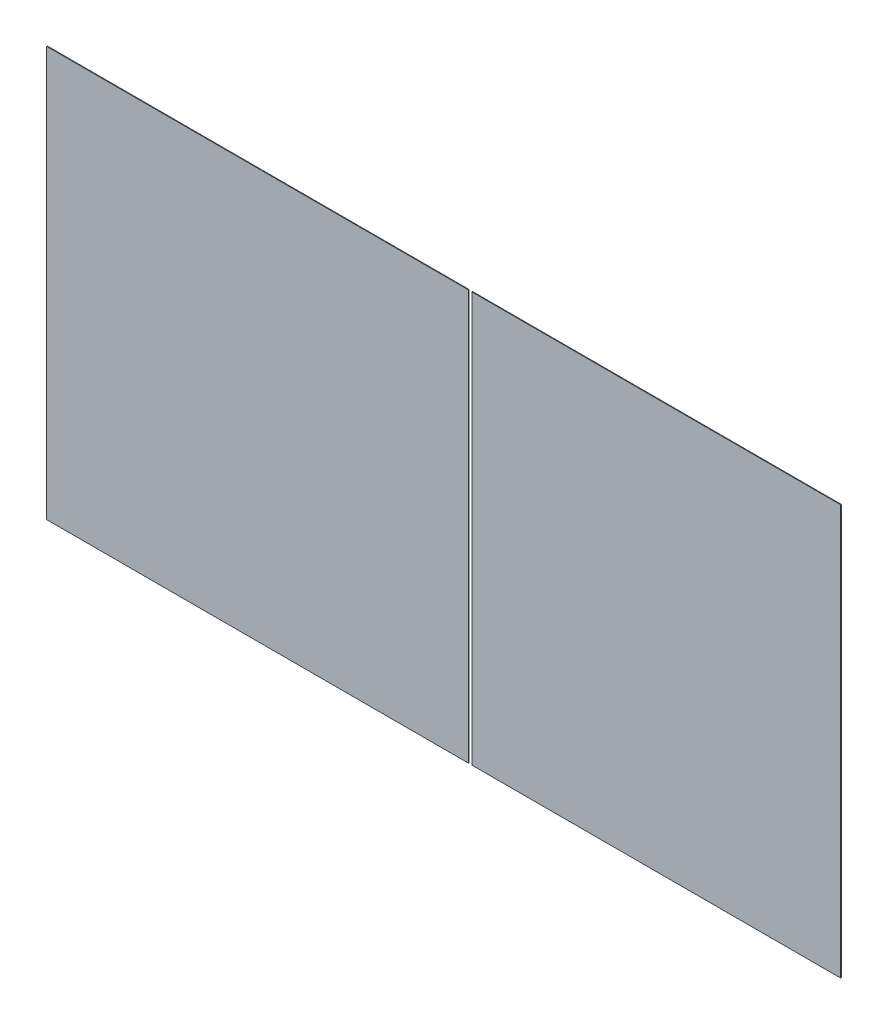
ISO-10303-21;
HEADER;
FILE_DESCRIPTION(('STEP AP214'),'2;1');
FILE_NAME('part.step','',(''),(''),'','','');
FILE_SCHEMA(('AUTOMOTIVE_DESIGN { 1 0 10303 214 1 1 1 1 }'));
ENDSEC;
DATA;
#1=APPLICATION_CONTEXT('core data for automotive mechanical design processes');
#2=APPLICATION_PROTOCOL_DEFINITION('international standard','automotive_design',2000,#1);
#3=PRODUCT_CONTEXT('',#1,'mechanical');
#4=PRODUCT('Part','Part','',(#3));
#5=PRODUCT_RELATED_PRODUCT_CATEGORY('part','',(#4));
#6=PRODUCT_DEFINITION_FORMATION('','',#4);
#7=PRODUCT_DEFINITION_CONTEXT('part definition',#1,'design');
#8=PRODUCT_DEFINITION('design','',#6,#7);
#9=PRODUCT_DEFINITION_SHAPE('','',#8);
#10=(LENGTH_UNIT() NAMED_UNIT(*) SI_UNIT(.MILLI.,.METRE.));
#11=(NAMED_UNIT(*) PLANE_ANGLE_UNIT() SI_UNIT($,.RADIAN.));
#12=(NAMED_UNIT(*) SI_UNIT($,.STERADIAN.) SOLID_ANGLE_UNIT());
#13=UNCERTAINTY_MEASURE_WITH_UNIT(LENGTH_MEASURE(1.E-05),#10,'distance_accuracy_value','');
#14=(GEOMETRIC_REPRESENTATION_CONTEXT(3) GLOBAL_UNCERTAINTY_ASSIGNED_CONTEXT((#13)) GLOBAL_UNIT_ASSIGNED_CONTEXT((#10,
#11,#12)) REPRESENTATION_CONTEXT('',''));
#15=CARTESIAN_POINT('',(0.,0.,0.));
#16=DIRECTION('',(0.,0.,1.));
#17=DIRECTION('',(1.,0.,0.));
#18=AXIS2_PLACEMENT_3D('',#15,#16,#17);
#19=CARTESIAN_POINT('',(563.759280044225,-291.074813881102,1.5));
#20=DIRECTION('',(0.,1.,0.));
#21=DIRECTION('',(-1.,0.,0.));
#22=AXIS2_PLACEMENT_3D('',#19,#20,#21);
#23=PLANE('',#22);
#24=DIRECTION('',(1.,0.,0.));
#25=VECTOR('',#24,1.);
#26=CARTESIAN_POINT('',(563.759280044225,-291.074813881102,1.5));
#27=LINE('',#26,#25);
#28=CARTESIAN_POINT('',(-262.299619083109,-291.074813881101,1.5));
#29=VERTEX_POINT('',#28);
#30=CARTESIAN_POINT('',(563.759280044225,-291.074813881102,1.5));
#31=VERTEX_POINT('',#30);
#32=EDGE_CURVE('E92',#29,#31,#27,.T.);
#33=ORIENTED_EDGE('',*,*,#32,.F.);
#34=DIRECTION('',(0.,0.,-1.));
#35=VECTOR('',#34,1.);
#36=CARTESIAN_POINT('',(-262.299619083109,-291.074813881102,1.5));
#37=LINE('',#36,#35);
#38=CARTESIAN_POINT('',(-262.299619083109,-291.074813881101,0.));
#39=VERTEX_POINT('',#38);
#40=EDGE_CURVE('E59',#29,#39,#37,.T.);
#41=ORIENTED_EDGE('',*,*,#40,.T.);
#42=DIRECTION('',(1.,0.,0.));
#43=VECTOR('',#42,1.);
#44=CARTESIAN_POINT('',(563.759280044225,-291.074813881102,0.));
#45=LINE('',#44,#43);
#46=CARTESIAN_POINT('',(563.759280044225,-291.074813881102,0.));
#47=VERTEX_POINT('',#46);
#48=EDGE_CURVE('E47',#39,#47,#45,.T.);
#49=ORIENTED_EDGE('',*,*,#48,.T.);
#50=DIRECTION('',(0.,0.,-1.));
#51=VECTOR('',#50,1.);
#52=CARTESIAN_POINT('',(563.759280044225,-291.074813881102,1.5));
#53=LINE('',#52,#51);
#54=EDGE_CURVE('E52',#31,#47,#53,.T.);
#55=ORIENTED_EDGE('',*,*,#54,.F.);
#56=EDGE_LOOP('',(#33,#41,#49,#55));
#57=FACE_BOUND('',#56,.T.);
#58=ADVANCED_FACE('F44',(#57),#23,.F.);
#59=CARTESIAN_POINT('',(563.759280044225,626.925186118899,1.5));
#60=DIRECTION('',(0.,-1.,0.));
#61=DIRECTION('',(1.,0.,0.));
#62=AXIS2_PLACEMENT_3D('',#59,#60,#61);
#63=PLANE('',#62);
#64=DIRECTION('',(-1.,0.,0.));
#65=VECTOR('',#64,1.);
#66=CARTESIAN_POINT('',(563.759280044225,626.925186118899,0.));
#67=LINE('',#66,#65);
#68=CARTESIAN_POINT('',(563.759280044225,626.925186118899,0.));
#69=VERTEX_POINT('',#68);
#70=CARTESIAN_POINT('',(-262.299619083109,626.925186118898,0.));
#71=VERTEX_POINT('',#70);
#72=EDGE_CURVE('E110',#69,#71,#67,.T.);
#73=ORIENTED_EDGE('',*,*,#72,.T.);
#74=DIRECTION('',(0.,0.,1.));
#75=VECTOR('',#74,1.);
#76=CARTESIAN_POINT('',(-262.299619083109,626.925186118898,1.5));
#77=LINE('',#76,#75);
#78=CARTESIAN_POINT('',(-262.299619083109,626.925186118899,1.5));
#79=VERTEX_POINT('',#78);
#80=EDGE_CURVE('E109',#71,#79,#77,.T.);
#81=ORIENTED_EDGE('',*,*,#80,.T.);
#82=DIRECTION('',(-1.,0.,0.));
#83=VECTOR('',#82,1.);
#84=CARTESIAN_POINT('',(563.759280044225,626.925186118899,1.5));
#85=LINE('',#84,#83);
#86=CARTESIAN_POINT('',(563.759280044225,626.925186118899,1.5));
#87=VERTEX_POINT('',#86);
#88=EDGE_CURVE('E102',#87,#79,#85,.T.);
#89=ORIENTED_EDGE('',*,*,#88,.F.);
#90=DIRECTION('',(0.,0.,-1.));
#91=VECTOR('',#90,1.);
#92=CARTESIAN_POINT('',(563.759280044225,626.925186118899,1.5));
#93=LINE('',#92,#91);
#94=EDGE_CURVE('E97',#87,#69,#93,.T.);
#95=ORIENTED_EDGE('',*,*,#94,.T.);
#96=EDGE_LOOP('',(#73,#81,#89,#95));
#97=FACE_BOUND('',#96,.T.);
#98=ADVANCED_FACE('F114',(#97),#63,.F.);
#99=CARTESIAN_POINT('',(0.,0.,1.5));
#100=DIRECTION('',(0.,0.,1.));
#101=DIRECTION('',(1.,0.,0.));
#102=AXIS2_PLACEMENT_3D('',#99,#100,#101);
#103=PLANE('',#102);
#104=DIRECTION('',(0.,1.,0.));
#105=VECTOR('',#104,1.);
#106=CARTESIAN_POINT('',(-262.299619083109,882.745406682729,1.5));
#107=LINE('',#106,#105);
#108=EDGE_CURVE('E12',#29,#79,#107,.T.);
#109=ORIENTED_EDGE('',*,*,#108,.F.);
#110=ORIENTED_EDGE('',*,*,#32,.T.);
#111=DIRECTION('',(0.,1.,0.));
#112=VECTOR('',#111,1.);
#113=CARTESIAN_POINT('',(563.759280044225,-291.074813881102,1.5));
#114=LINE('',#113,#112);
#115=EDGE_CURVE('E96',#31,#87,#114,.T.);
#116=ORIENTED_EDGE('',*,*,#115,.T.);
#117=ORIENTED_EDGE('',*,*,#88,.T.);
#118=EDGE_LOOP('',(#109,#110,#116,#117));
#119=FACE_BOUND('',#118,.T.);
#120=ADVANCED_FACE('F93',(#119),#103,.T.);
#121=CARTESIAN_POINT('',(0.,0.,0.));
#122=DIRECTION('',(0.,0.,1.));
#123=DIRECTION('',(1.,0.,0.));
#124=AXIS2_PLACEMENT_3D('',#121,#122,#123);
#125=PLANE('',#124);
#126=ORIENTED_EDGE('',*,*,#48,.F.);
#127=DIRECTION('',(0.,1.,0.));
#128=VECTOR('',#127,1.);
#129=CARTESIAN_POINT('',(-262.299619083109,0.,0.));
#130=LINE('',#129,#128);
#131=EDGE_CURVE('E65',#39,#71,#130,.T.);
#132=ORIENTED_EDGE('',*,*,#131,.T.);
#133=ORIENTED_EDGE('',*,*,#72,.F.);
#134=DIRECTION('',(0.,1.,0.));
#135=VECTOR('',#134,1.);
#136=CARTESIAN_POINT('',(563.759280044225,-291.074813881102,0.));
#137=LINE('',#136,#135);
#138=EDGE_CURVE('E80',#47,#69,#137,.T.);
#139=ORIENTED_EDGE('',*,*,#138,.F.);
#140=EDGE_LOOP('',(#126,#132,#133,#139));
#141=FACE_BOUND('',#140,.T.);
#142=ADVANCED_FACE('F116',(#141),#125,.F.);
#143=CARTESIAN_POINT('',(563.759280044225,-291.074813881102,1.5));
#144=DIRECTION('',(-1.,0.,0.));
#145=DIRECTION('',(0.,0.,1.));
#146=AXIS2_PLACEMENT_3D('',#143,#144,#145);
#147=PLANE('',#146);
#148=ORIENTED_EDGE('',*,*,#138,.T.);
#149=ORIENTED_EDGE('',*,*,#94,.F.);
#150=ORIENTED_EDGE('',*,*,#115,.F.);
#151=ORIENTED_EDGE('',*,*,#54,.T.);
#152=EDGE_LOOP('',(#148,#149,#150,#151));
#153=FACE_BOUND('',#152,.T.);
#154=ADVANCED_FACE('F100',(#153),#147,.F.);
#155=CARTESIAN_POINT('',(-262.299619083109,882.745406682729,0.));
#156=DIRECTION('',(1.,0.,0.));
#157=DIRECTION('',(0.,1.,0.));
#158=AXIS2_PLACEMENT_3D('',#155,#156,#157);
#159=PLANE('',#158);
#160=ORIENTED_EDGE('',*,*,#108,.T.);
#161=ORIENTED_EDGE('',*,*,#80,.F.);
#162=ORIENTED_EDGE('',*,*,#131,.F.);
#163=ORIENTED_EDGE('',*,*,#40,.F.);
#164=EDGE_LOOP('',(#160,#161,#162,#163));
#165=FACE_BOUND('',#164,.T.);
#166=ADVANCED_FACE('F124',(#165),#159,.F.);
#167=CLOSED_SHELL('',(#58,#98,#120,#142,#154,#166));
#168=MANIFOLD_SOLID_BREP('B2',#167);
#169=CARTESIAN_POINT('',(-1214.24071995577,-291.074813881102,1.5));
#170=DIRECTION('',(1.,0.,0.));
#171=DIRECTION('',(0.,0.,-1.));
#172=AXIS2_PLACEMENT_3D('',#169,#170,#171);
#173=PLANE('',#172);
#174=DIRECTION('',(0.,-1.,0.));
#175=VECTOR('',#174,1.);
#176=CARTESIAN_POINT('',(-1214.24071995577,-291.074813881102,0.));
#177=LINE('',#176,#175);
#178=CARTESIAN_POINT('',(-1214.24071995577,626.925186118898,0.));
#179=VERTEX_POINT('',#178);
#180=CARTESIAN_POINT('',(-1214.24071995577,-291.074813881102,0.));
#181=VERTEX_POINT('',#180);
#182=EDGE_CURVE('E218',#179,#181,#177,.T.);
#183=ORIENTED_EDGE('',*,*,#182,.T.);
#184=DIRECTION('',(0.,0.,-1.));
#185=VECTOR('',#184,1.);
#186=CARTESIAN_POINT('',(-1214.24071995577,-291.074813881102,1.5));
#187=LINE('',#186,#185);
#188=CARTESIAN_POINT('',(-1214.24071995577,-291.074813881102,1.5));
#189=VERTEX_POINT('',#188);
#190=EDGE_CURVE('E174',#189,#181,#187,.T.);
#191=ORIENTED_EDGE('',*,*,#190,.F.);
#192=DIRECTION('',(0.,-1.,0.));
#193=VECTOR('',#192,1.);
#194=CARTESIAN_POINT('',(-1214.24071995577,-291.074813881102,1.5));
#195=LINE('',#194,#193);
#196=CARTESIAN_POINT('',(-1214.24071995577,626.925186118898,1.5));
#197=VERTEX_POINT('',#196);
#198=EDGE_CURVE('E212',#197,#189,#195,.T.);
#199=ORIENTED_EDGE('',*,*,#198,.F.);
#200=DIRECTION('',(0.,0.,-1.));
#201=VECTOR('',#200,1.);
#202=CARTESIAN_POINT('',(-1214.24071995577,626.925186118898,1.5));
#203=LINE('',#202,#201);
#204=EDGE_CURVE('E206',#197,#179,#203,.T.);
#205=ORIENTED_EDGE('',*,*,#204,.T.);
#206=EDGE_LOOP('',(#183,#191,#199,#205));
#207=FACE_BOUND('',#206,.T.);
#208=ADVANCED_FACE('F167',(#207),#173,.F.);
#209=CARTESIAN_POINT('',(0.,0.,0.));
#210=DIRECTION('',(0.,0.,1.));
#211=DIRECTION('',(1.,0.,0.));
#212=AXIS2_PLACEMENT_3D('',#209,#210,#211);
#213=PLANE('',#212);
#214=DIRECTION('',(-1.,0.,0.));
#215=VECTOR('',#214,1.);
#216=CARTESIAN_POINT('',(563.759280044225,626.925186118899,0.));
#217=LINE('',#216,#215);
#218=CARTESIAN_POINT('',(-270.068142549832,626.925186118899,0.));
#219=VERTEX_POINT('',#218);
#220=EDGE_CURVE('E203',#219,#179,#217,.T.);
#221=ORIENTED_EDGE('',*,*,#220,.F.);
#222=DIRECTION('',(0.,-1.,0.));
#223=VECTOR('',#222,1.);
#224=CARTESIAN_POINT('',(-270.068142549832,0.,0.));
#225=LINE('',#224,#223);
#226=CARTESIAN_POINT('',(-270.068142549832,-291.074813881102,0.));
#227=VERTEX_POINT('',#226);
#228=EDGE_CURVE('E42',#219,#227,#225,.T.);
#229=ORIENTED_EDGE('',*,*,#228,.T.);
#230=DIRECTION('',(1.,0.,0.));
#231=VECTOR('',#230,1.);
#232=CARTESIAN_POINT('',(563.759280044225,-291.074813881102,0.));
#233=LINE('',#232,#231);
#234=EDGE_CURVE('E213',#181,#227,#233,.T.);
#235=ORIENTED_EDGE('',*,*,#234,.F.);
#236=ORIENTED_EDGE('',*,*,#182,.F.);
#237=EDGE_LOOP('',(#221,#229,#235,#236));
#238=FACE_BOUND('',#237,.T.);
#239=ADVANCED_FACE('F220',(#238),#213,.F.);
#240=CARTESIAN_POINT('',(0.,0.,1.5));
#241=DIRECTION('',(0.,0.,1.));
#242=DIRECTION('',(1.,0.,0.));
#243=AXIS2_PLACEMENT_3D('',#240,#241,#242);
#244=PLANE('',#243);
#245=DIRECTION('',(0.,-1.,0.));
#246=VECTOR('',#245,1.);
#247=CARTESIAN_POINT('',(-270.068142549832,882.745406682729,1.5));
#248=LINE('',#247,#246);
#249=CARTESIAN_POINT('',(-270.068142549832,626.925186118899,1.5));
#250=VERTEX_POINT('',#249);
#251=CARTESIAN_POINT('',(-270.068142549832,-291.074813881101,1.5));
#252=VERTEX_POINT('',#251);
#253=EDGE_CURVE('E237',#250,#252,#248,.T.);
#254=ORIENTED_EDGE('',*,*,#253,.F.);
#255=DIRECTION('',(-1.,0.,0.));
#256=VECTOR('',#255,1.);
#257=CARTESIAN_POINT('',(563.759280044225,626.925186118899,1.5));
#258=LINE('',#257,#256);
#259=EDGE_CURVE('E189',#250,#197,#258,.T.);
#260=ORIENTED_EDGE('',*,*,#259,.T.);
#261=ORIENTED_EDGE('',*,*,#198,.T.);
#262=DIRECTION('',(1.,0.,0.));
#263=VECTOR('',#262,1.);
#264=CARTESIAN_POINT('',(563.759280044225,-291.074813881102,1.5));
#265=LINE('',#264,#263);
#266=EDGE_CURVE('E231',#189,#252,#265,.T.);
#267=ORIENTED_EDGE('',*,*,#266,.T.);
#268=EDGE_LOOP('',(#254,#260,#261,#267));
#269=FACE_BOUND('',#268,.T.);
#270=ADVANCED_FACE('F233',(#269),#244,.T.);
#271=CARTESIAN_POINT('',(563.759280044225,626.925186118899,1.5));
#272=DIRECTION('',(0.,-1.,0.));
#273=DIRECTION('',(1.,0.,0.));
#274=AXIS2_PLACEMENT_3D('',#271,#272,#273);
#275=PLANE('',#274);
#276=ORIENTED_EDGE('',*,*,#259,.F.);
#277=DIRECTION('',(0.,0.,-1.));
#278=VECTOR('',#277,1.);
#279=CARTESIAN_POINT('',(-270.068142549832,626.925186118898,1.5));
#280=LINE('',#279,#278);
#281=EDGE_CURVE('E209',#250,#219,#280,.T.);
#282=ORIENTED_EDGE('',*,*,#281,.T.);
#283=ORIENTED_EDGE('',*,*,#220,.T.);
#284=ORIENTED_EDGE('',*,*,#204,.F.);
#285=EDGE_LOOP('',(#276,#282,#283,#284));
#286=FACE_BOUND('',#285,.T.);
#287=ADVANCED_FACE('F205',(#286),#275,.F.);
#288=CARTESIAN_POINT('',(563.759280044225,-291.074813881102,1.5));
#289=DIRECTION('',(0.,1.,0.));
#290=DIRECTION('',(-1.,0.,0.));
#291=AXIS2_PLACEMENT_3D('',#288,#289,#290);
#292=PLANE('',#291);
#293=ORIENTED_EDGE('',*,*,#234,.T.);
#294=DIRECTION('',(0.,0.,1.));
#295=VECTOR('',#294,1.);
#296=CARTESIAN_POINT('',(-270.068142549832,-291.074813881102,1.5));
#297=LINE('',#296,#295);
#298=EDGE_CURVE('E181',#227,#252,#297,.T.);
#299=ORIENTED_EDGE('',*,*,#298,.T.);
#300=ORIENTED_EDGE('',*,*,#266,.F.);
#301=ORIENTED_EDGE('',*,*,#190,.T.);
#302=EDGE_LOOP('',(#293,#299,#300,#301));
#303=FACE_BOUND('',#302,.T.);
#304=ADVANCED_FACE('F229',(#303),#292,.F.);
#305=CARTESIAN_POINT('',(-270.068142549832,882.745406682729,0.));
#306=DIRECTION('',(-1.,0.,0.));
#307=DIRECTION('',(0.,-1.,0.));
#308=AXIS2_PLACEMENT_3D('',#305,#306,#307);
#309=PLANE('',#308);
#310=ORIENTED_EDGE('',*,*,#228,.F.);
#311=ORIENTED_EDGE('',*,*,#281,.F.);
#312=ORIENTED_EDGE('',*,*,#253,.T.);
#313=ORIENTED_EDGE('',*,*,#298,.F.);
#314=EDGE_LOOP('',(#310,#311,#312,#313));
#315=FACE_BOUND('',#314,.T.);
#316=ADVANCED_FACE('F238',(#315),#309,.F.);
#317=CLOSED_SHELL('',(#208,#239,#270,#287,#304,#316));
#318=MANIFOLD_SOLID_BREP('B6',#317);
#319=ADVANCED_BREP_SHAPE_REPRESENTATION('',(#18,#168,#318),#14);
#320=SHAPE_DEFINITION_REPRESENTATION(#9,#319);
ENDSEC;
END-ISO-10303-21;
